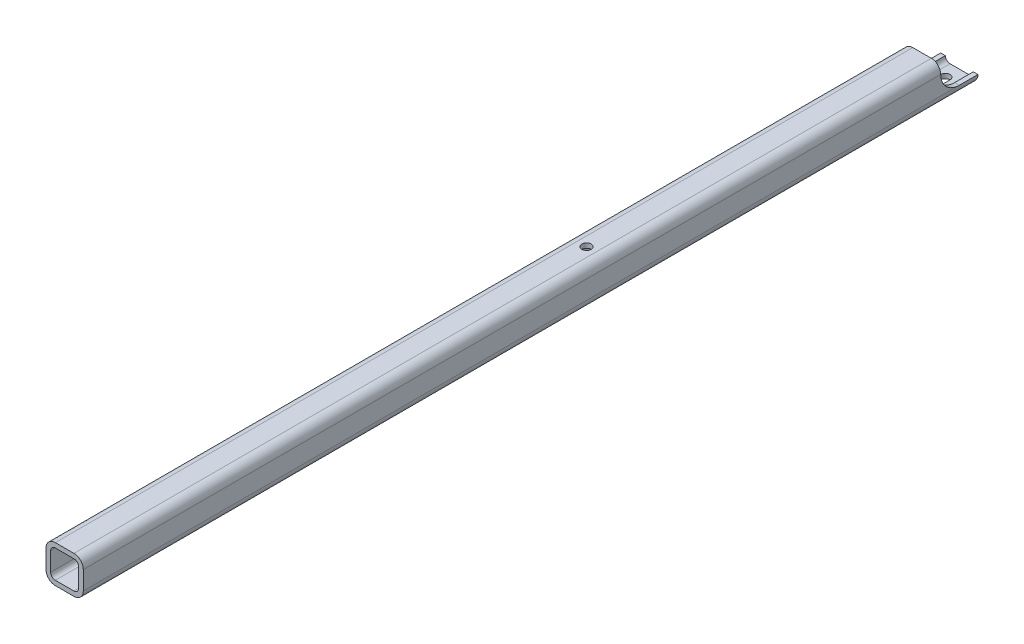
ISO-10303-21;
HEADER;
FILE_DESCRIPTION(('STEP AP214'),'2;1');
FILE_NAME('part.step','',(''),(''),'','','');
FILE_SCHEMA(('AUTOMOTIVE_DESIGN { 1 0 10303 214 1 1 1 1 }'));
ENDSEC;
DATA;
#1=APPLICATION_CONTEXT('core data for automotive mechanical design processes');
#2=APPLICATION_PROTOCOL_DEFINITION('international standard','automotive_design',2000,#1);
#3=PRODUCT_CONTEXT('',#1,'mechanical');
#4=PRODUCT('Part','Part','',(#3));
#5=PRODUCT_RELATED_PRODUCT_CATEGORY('part','',(#4));
#6=PRODUCT_DEFINITION_FORMATION('','',#4);
#7=PRODUCT_DEFINITION_CONTEXT('part definition',#1,'design');
#8=PRODUCT_DEFINITION('design','',#6,#7);
#9=PRODUCT_DEFINITION_SHAPE('','',#8);
#10=(LENGTH_UNIT() NAMED_UNIT(*) SI_UNIT(.MILLI.,.METRE.));
#11=(NAMED_UNIT(*) PLANE_ANGLE_UNIT() SI_UNIT($,.RADIAN.));
#12=(NAMED_UNIT(*) SI_UNIT($,.STERADIAN.) SOLID_ANGLE_UNIT());
#13=UNCERTAINTY_MEASURE_WITH_UNIT(LENGTH_MEASURE(1.E-05),#10,'distance_accuracy_value','');
#14=(GEOMETRIC_REPRESENTATION_CONTEXT(3) GLOBAL_UNCERTAINTY_ASSIGNED_CONTEXT((#13)) GLOBAL_UNIT_ASSIGNED_CONTEXT((#10,
#11,#12)) REPRESENTATION_CONTEXT('',''));
#15=CARTESIAN_POINT('',(0.,0.,0.));
#16=DIRECTION('',(0.,0.,1.));
#17=DIRECTION('',(1.,0.,0.));
#18=AXIS2_PLACEMENT_3D('',#15,#16,#17);
#19=CARTESIAN_POINT('',(38.1,38.1,609.6));
#20=DIRECTION('',(0.,0.,1.));
#21=DIRECTION('',(1.,0.,0.));
#22=AXIS2_PLACEMENT_3D('',#19,#20,#21);
#23=PLANE('',#22);
#24=CARTESIAN_POINT('',(38.1,38.1,609.6));
#25=DIRECTION('',(0.,0.,1.));
#26=DIRECTION('',(1.,0.,0.));
#27=AXIS2_PLACEMENT_3D('',#24,#25,#26);
#28=CIRCLE('',#27,12.7);
#29=CARTESIAN_POINT('',(50.8,38.1,609.6));
#30=VERTEX_POINT('',#29);
#31=CARTESIAN_POINT('',(38.1,50.8,609.6));
#32=VERTEX_POINT('',#31);
#33=EDGE_CURVE('E291',#30,#32,#28,.T.);
#34=ORIENTED_EDGE('',*,*,#33,.T.);
#35=DIRECTION('',(-1.,0.,0.));
#36=VECTOR('',#35,1.);
#37=CARTESIAN_POINT('',(38.1,50.8,609.6));
#38=LINE('',#37,#36);
#39=CARTESIAN_POINT('',(12.7,50.8,609.6));
#40=VERTEX_POINT('',#39);
#41=EDGE_CURVE('E294',#32,#40,#38,.T.);
#42=ORIENTED_EDGE('',*,*,#41,.T.);
#43=CARTESIAN_POINT('',(12.7,38.1,609.6));
#44=DIRECTION('',(0.,0.,1.));
#45=DIRECTION('',(1.,0.,0.));
#46=AXIS2_PLACEMENT_3D('',#43,#44,#45);
#47=CIRCLE('',#46,12.7);
#48=CARTESIAN_POINT('',(0.,38.1,609.6));
#49=VERTEX_POINT('',#48);
#50=EDGE_CURVE('E297',#40,#49,#47,.T.);
#51=ORIENTED_EDGE('',*,*,#50,.T.);
#52=DIRECTION('',(0.,-1.,0.));
#53=VECTOR('',#52,1.);
#54=CARTESIAN_POINT('',(0.,12.7,609.6));
#55=LINE('',#54,#53);
#56=CARTESIAN_POINT('',(0.,12.7,609.6));
#57=VERTEX_POINT('',#56);
#58=EDGE_CURVE('E299',#49,#57,#55,.T.);
#59=ORIENTED_EDGE('',*,*,#58,.T.);
#60=CARTESIAN_POINT('',(12.7,12.7,609.6));
#61=DIRECTION('',(0.,0.,1.));
#62=DIRECTION('',(1.,0.,0.));
#63=AXIS2_PLACEMENT_3D('',#60,#61,#62);
#64=CIRCLE('',#63,12.7);
#65=CARTESIAN_POINT('',(12.7,0.,609.6));
#66=VERTEX_POINT('',#65);
#67=EDGE_CURVE('E301',#57,#66,#64,.T.);
#68=ORIENTED_EDGE('',*,*,#67,.T.);
#69=DIRECTION('',(1.,0.,0.));
#70=VECTOR('',#69,1.);
#71=CARTESIAN_POINT('',(12.7,0.,609.6));
#72=LINE('',#71,#70);
#73=CARTESIAN_POINT('',(38.1,0.,609.6));
#74=VERTEX_POINT('',#73);
#75=EDGE_CURVE('E303',#66,#74,#72,.T.);
#76=ORIENTED_EDGE('',*,*,#75,.T.);
#77=CARTESIAN_POINT('',(38.1,12.7,609.6));
#78=DIRECTION('',(0.,0.,1.));
#79=DIRECTION('',(1.,0.,0.));
#80=AXIS2_PLACEMENT_3D('',#77,#78,#79);
#81=CIRCLE('',#80,12.7);
#82=CARTESIAN_POINT('',(50.8,12.7,609.6));
#83=VERTEX_POINT('',#82);
#84=EDGE_CURVE('E305',#74,#83,#81,.T.);
#85=ORIENTED_EDGE('',*,*,#84,.T.);
#86=DIRECTION('',(0.,1.,0.));
#87=VECTOR('',#86,1.);
#88=CARTESIAN_POINT('',(50.8,38.1,609.6));
#89=LINE('',#88,#87);
#90=EDGE_CURVE('E307',#83,#30,#89,.T.);
#91=ORIENTED_EDGE('',*,*,#90,.T.);
#92=EDGE_LOOP('',(#34,#42,#51,#59,#68,#76,#85,#91));
#93=FACE_BOUND('',#92,.T.);
#94=DIRECTION('',(0.,-1.,0.));
#95=VECTOR('',#94,1.);
#96=CARTESIAN_POINT('',(6.35,12.7,609.6));
#97=LINE('',#96,#95);
#98=CARTESIAN_POINT('',(6.35,38.1,609.6));
#99=VERTEX_POINT('',#98);
#100=CARTESIAN_POINT('',(6.35,12.7,609.6));
#101=VERTEX_POINT('',#100);
#102=EDGE_CURVE('E247',#99,#101,#97,.T.);
#103=ORIENTED_EDGE('',*,*,#102,.F.);
#104=CARTESIAN_POINT('',(12.7,38.1,609.6));
#105=DIRECTION('',(0.,0.,1.));
#106=DIRECTION('',(1.,0.,0.));
#107=AXIS2_PLACEMENT_3D('',#104,#105,#106);
#108=CIRCLE('',#107,6.35);
#109=CARTESIAN_POINT('',(12.7,44.45,609.6));
#110=VERTEX_POINT('',#109);
#111=EDGE_CURVE('E245',#110,#99,#108,.T.);
#112=ORIENTED_EDGE('',*,*,#111,.F.);
#113=DIRECTION('',(-1.,0.,0.));
#114=VECTOR('',#113,1.);
#115=CARTESIAN_POINT('',(38.1,44.45,609.6));
#116=LINE('',#115,#114);
#117=CARTESIAN_POINT('',(38.1,44.45,609.6));
#118=VERTEX_POINT('',#117);
#119=EDGE_CURVE('E261',#118,#110,#116,.T.);
#120=ORIENTED_EDGE('',*,*,#119,.F.);
#121=CARTESIAN_POINT('',(38.1,38.1,609.6));
#122=DIRECTION('',(0.,0.,1.));
#123=DIRECTION('',(1.,0.,0.));
#124=AXIS2_PLACEMENT_3D('',#121,#122,#123);
#125=CIRCLE('',#124,6.35);
#126=CARTESIAN_POINT('',(44.45,38.1,609.6));
#127=VERTEX_POINT('',#126);
#128=EDGE_CURVE('E258',#127,#118,#125,.T.);
#129=ORIENTED_EDGE('',*,*,#128,.F.);
#130=DIRECTION('',(0.,1.,0.));
#131=VECTOR('',#130,1.);
#132=CARTESIAN_POINT('',(44.45,38.1,609.6));
#133=LINE('',#132,#131);
#134=CARTESIAN_POINT('',(44.45,12.7,609.6));
#135=VERTEX_POINT('',#134);
#136=EDGE_CURVE('E256',#135,#127,#133,.T.);
#137=ORIENTED_EDGE('',*,*,#136,.F.);
#138=CARTESIAN_POINT('',(38.1,12.7,609.6));
#139=DIRECTION('',(0.,0.,1.));
#140=DIRECTION('',(1.,0.,0.));
#141=AXIS2_PLACEMENT_3D('',#138,#139,#140);
#142=CIRCLE('',#141,6.35);
#143=CARTESIAN_POINT('',(38.1,6.35,609.6));
#144=VERTEX_POINT('',#143);
#145=EDGE_CURVE('E254',#144,#135,#142,.T.);
#146=ORIENTED_EDGE('',*,*,#145,.F.);
#147=DIRECTION('',(1.,0.,0.));
#148=VECTOR('',#147,1.);
#149=CARTESIAN_POINT('',(12.7,6.35,609.6));
#150=LINE('',#149,#148);
#151=CARTESIAN_POINT('',(12.7,6.35,609.6));
#152=VERTEX_POINT('',#151);
#153=EDGE_CURVE('E252',#152,#144,#150,.T.);
#154=ORIENTED_EDGE('',*,*,#153,.F.);
#155=CARTESIAN_POINT('',(12.7,12.7,609.6));
#156=DIRECTION('',(0.,0.,1.));
#157=DIRECTION('',(1.,0.,0.));
#158=AXIS2_PLACEMENT_3D('',#155,#156,#157);
#159=CIRCLE('',#158,6.35);
#160=EDGE_CURVE('E250',#101,#152,#159,.T.);
#161=ORIENTED_EDGE('',*,*,#160,.F.);
#162=EDGE_LOOP('',(#103,#112,#120,#129,#137,#146,#154,#161));
#163=FACE_BOUND('',#162,.T.);
#164=ADVANCED_FACE('F17',(#93,#163),#23,.T.);
#165=CARTESIAN_POINT('',(38.1,38.1,-609.6));
#166=DIRECTION('',(0.,0.,1.));
#167=DIRECTION('',(1.,0.,0.));
#168=AXIS2_PLACEMENT_3D('',#165,#166,#167);
#169=PLANE('',#168);
#170=CARTESIAN_POINT('',(12.7,12.7,-609.6));
#171=DIRECTION('',(0.,0.,1.));
#172=DIRECTION('',(1.,0.,0.));
#173=AXIS2_PLACEMENT_3D('',#170,#171,#172);
#174=CIRCLE('',#173,12.7);
#175=CARTESIAN_POINT('',(0.,12.7,-609.6));
#176=VERTEX_POINT('',#175);
#177=CARTESIAN_POINT('',(12.7,0.,-609.6));
#178=VERTEX_POINT('',#177);
#179=EDGE_CURVE('E290',#176,#178,#174,.T.);
#180=ORIENTED_EDGE('',*,*,#179,.F.);
#181=DIRECTION('',(1.,0.,0.));
#182=VECTOR('',#181,1.);
#183=CARTESIAN_POINT('',(0.,12.7,-609.6));
#184=LINE('',#183,#182);
#185=CARTESIAN_POINT('',(6.35,12.7,-609.6));
#186=VERTEX_POINT('',#185);
#187=EDGE_CURVE('E217',#176,#186,#184,.T.);
#188=ORIENTED_EDGE('',*,*,#187,.T.);
#189=CARTESIAN_POINT('',(12.7,12.7,-609.6));
#190=DIRECTION('',(0.,0.,1.));
#191=DIRECTION('',(1.,0.,0.));
#192=AXIS2_PLACEMENT_3D('',#189,#190,#191);
#193=CIRCLE('',#192,6.35);
#194=CARTESIAN_POINT('',(12.7,6.35,-609.6));
#195=VERTEX_POINT('',#194);
#196=EDGE_CURVE('E244',#186,#195,#193,.T.);
#197=ORIENTED_EDGE('',*,*,#196,.T.);
#198=DIRECTION('',(1.,0.,0.));
#199=VECTOR('',#198,1.);
#200=CARTESIAN_POINT('',(12.7,6.35,-609.6));
#201=LINE('',#200,#199);
#202=CARTESIAN_POINT('',(38.1,6.35,-609.6));
#203=VERTEX_POINT('',#202);
#204=EDGE_CURVE('E266',#195,#203,#201,.T.);
#205=ORIENTED_EDGE('',*,*,#204,.T.);
#206=CARTESIAN_POINT('',(38.1,12.7,-609.6));
#207=DIRECTION('',(0.,0.,1.));
#208=DIRECTION('',(1.,0.,0.));
#209=AXIS2_PLACEMENT_3D('',#206,#207,#208);
#210=CIRCLE('',#209,6.35);
#211=CARTESIAN_POINT('',(44.45,12.7,-609.6));
#212=VERTEX_POINT('',#211);
#213=EDGE_CURVE('E248',#203,#212,#210,.T.);
#214=ORIENTED_EDGE('',*,*,#213,.T.);
#215=CARTESIAN_POINT('',(50.8,12.7,-609.6));
#216=VERTEX_POINT('',#215);
#217=EDGE_CURVE('E212',#212,#216,#184,.T.);
#218=ORIENTED_EDGE('',*,*,#217,.T.);
#219=CARTESIAN_POINT('',(38.1,12.7,-609.6));
#220=DIRECTION('',(0.,0.,1.));
#221=DIRECTION('',(1.,0.,0.));
#222=AXIS2_PLACEMENT_3D('',#219,#220,#221);
#223=CIRCLE('',#222,12.7);
#224=CARTESIAN_POINT('',(38.1,0.,-609.6));
#225=VERTEX_POINT('',#224);
#226=EDGE_CURVE('E295',#225,#216,#223,.T.);
#227=ORIENTED_EDGE('',*,*,#226,.F.);
#228=DIRECTION('',(1.,0.,0.));
#229=VECTOR('',#228,1.);
#230=CARTESIAN_POINT('',(12.7,0.,-609.6));
#231=LINE('',#230,#229);
#232=EDGE_CURVE('E311',#178,#225,#231,.T.);
#233=ORIENTED_EDGE('',*,*,#232,.F.);
#234=EDGE_LOOP('',(#180,#188,#197,#205,#214,#218,#227,#233));
#235=FACE_BOUND('',#234,.T.);
#236=ADVANCED_FACE('F418',(#235),#169,.F.);
#237=CARTESIAN_POINT('',(38.1,38.1,609.6));
#238=DIRECTION('',(0.,0.,-1.));
#239=DIRECTION('',(-1.,0.,0.));
#240=AXIS2_PLACEMENT_3D('',#237,#238,#239);
#241=CYLINDRICAL_SURFACE('',#240,12.7);
#242=DIRECTION('',(0.,0.,-1.));
#243=VECTOR('',#242,1.);
#244=CARTESIAN_POINT('',(50.8,38.1,609.6));
#245=LINE('',#244,#243);
#246=CARTESIAN_POINT('',(50.8,38.1,-558.8));
#247=VERTEX_POINT('',#246);
#248=EDGE_CURVE('E309',#30,#247,#245,.T.);
#249=ORIENTED_EDGE('',*,*,#248,.T.);
#250=CARTESIAN_POINT('',(38.1,38.1,-558.8));
#251=DIRECTION('',(0.,0.,1.));
#252=DIRECTION('',(0.,-1.,0.));
#253=AXIS2_PLACEMENT_3D('',#250,#251,#252);
#254=CIRCLE('',#253,12.7);
#255=CARTESIAN_POINT('',(38.1,50.8,-558.8));
#256=VERTEX_POINT('',#255);
#257=EDGE_CURVE('E227',#247,#256,#254,.T.);
#258=ORIENTED_EDGE('',*,*,#257,.T.);
#259=DIRECTION('',(0.,0.,-1.));
#260=VECTOR('',#259,1.);
#261=CARTESIAN_POINT('',(38.1,50.8,609.6));
#262=LINE('',#261,#260);
#263=EDGE_CURVE('E332',#32,#256,#262,.T.);
#264=ORIENTED_EDGE('',*,*,#263,.F.);
#265=ORIENTED_EDGE('',*,*,#33,.F.);
#266=EDGE_LOOP('',(#249,#258,#264,#265));
#267=FACE_BOUND('',#266,.T.);
#268=ADVANCED_FACE('F368',(#267),#241,.T.);
#269=CARTESIAN_POINT('',(38.1,50.8,609.6));
#270=DIRECTION('',(0.,-1.,0.));
#271=DIRECTION('',(1.,0.,0.));
#272=AXIS2_PLACEMENT_3D('',#269,#270,#271);
#273=PLANE('',#272);
#274=CARTESIAN_POINT('',(25.4,50.8,-101.6));
#275=DIRECTION('',(0.,1.,0.));
#276=DIRECTION('',(0.,0.,1.));
#277=AXIS2_PLACEMENT_3D('',#274,#275,#276);
#278=CIRCLE('',#277,6.35);
#279=CARTESIAN_POINT('',(25.4,50.8,-95.25));
#280=VERTEX_POINT('',#279);
#281=EDGE_CURVE('E232',#280,#280,#278,.T.);
#282=ORIENTED_EDGE('',*,*,#281,.F.);
#283=EDGE_LOOP('',(#282));
#284=FACE_BOUND('',#283,.T.);
#285=ORIENTED_EDGE('',*,*,#263,.T.);
#286=DIRECTION('',(1.,0.,0.));
#287=VECTOR('',#286,1.);
#288=CARTESIAN_POINT('',(0.,50.8,-558.8));
#289=LINE('',#288,#287);
#290=CARTESIAN_POINT('',(12.7,50.8,-558.8));
#291=VERTEX_POINT('',#290);
#292=EDGE_CURVE('E214',#291,#256,#289,.T.);
#293=ORIENTED_EDGE('',*,*,#292,.F.);
#294=DIRECTION('',(0.,0.,-1.));
#295=VECTOR('',#294,1.);
#296=CARTESIAN_POINT('',(12.7,50.8,609.6));
#297=LINE('',#296,#295);
#298=EDGE_CURVE('E329',#40,#291,#297,.T.);
#299=ORIENTED_EDGE('',*,*,#298,.F.);
#300=ORIENTED_EDGE('',*,*,#41,.F.);
#301=EDGE_LOOP('',(#285,#293,#299,#300));
#302=FACE_BOUND('',#301,.T.);
#303=ADVANCED_FACE('F430',(#284,#302),#273,.F.);
#304=CARTESIAN_POINT('',(12.7,38.1,609.6));
#305=DIRECTION('',(0.,0.,-1.));
#306=DIRECTION('',(-1.,0.,0.));
#307=AXIS2_PLACEMENT_3D('',#304,#305,#306);
#308=CYLINDRICAL_SURFACE('',#307,12.7);
#309=ORIENTED_EDGE('',*,*,#298,.T.);
#310=CARTESIAN_POINT('',(12.7,38.1,-558.8));
#311=DIRECTION('',(0.,0.,1.));
#312=DIRECTION('',(0.,-1.,0.));
#313=AXIS2_PLACEMENT_3D('',#310,#311,#312);
#314=CIRCLE('',#313,12.7);
#315=CARTESIAN_POINT('',(0.,38.1,-558.8));
#316=VERTEX_POINT('',#315);
#317=EDGE_CURVE('E224',#291,#316,#314,.T.);
#318=ORIENTED_EDGE('',*,*,#317,.T.);
#319=DIRECTION('',(0.,0.,-1.));
#320=VECTOR('',#319,1.);
#321=CARTESIAN_POINT('',(0.,38.1,609.6));
#322=LINE('',#321,#320);
#323=EDGE_CURVE('E326',#49,#316,#322,.T.);
#324=ORIENTED_EDGE('',*,*,#323,.F.);
#325=ORIENTED_EDGE('',*,*,#50,.F.);
#326=EDGE_LOOP('',(#309,#318,#324,#325));
#327=FACE_BOUND('',#326,.T.);
#328=ADVANCED_FACE('F397',(#327),#308,.T.);
#329=CARTESIAN_POINT('',(0.,12.7,609.6));
#330=DIRECTION('',(1.,0.,0.));
#331=DIRECTION('',(0.,1.,0.));
#332=AXIS2_PLACEMENT_3D('',#329,#330,#331);
#333=PLANE('',#332);
#334=ORIENTED_EDGE('',*,*,#323,.T.);
#335=CARTESIAN_POINT('',(0.,38.1,-584.2));
#336=DIRECTION('',(1.,0.,0.));
#337=DIRECTION('',(0.,1.,0.));
#338=AXIS2_PLACEMENT_3D('',#335,#336,#337);
#339=CIRCLE('',#338,25.4);
#340=CARTESIAN_POINT('',(0.,12.7,-584.2));
#341=VERTEX_POINT('',#340);
#342=EDGE_CURVE('E349',#316,#341,#339,.T.);
#343=ORIENTED_EDGE('',*,*,#342,.T.);
#344=DIRECTION('',(0.,0.,-1.));
#345=VECTOR('',#344,1.);
#346=CARTESIAN_POINT('',(0.,12.7,609.6));
#347=LINE('',#346,#345);
#348=EDGE_CURVE('E41',#57,#341,#347,.T.);
#349=ORIENTED_EDGE('',*,*,#348,.F.);
#350=ORIENTED_EDGE('',*,*,#58,.F.);
#351=EDGE_LOOP('',(#334,#343,#349,#350));
#352=FACE_BOUND('',#351,.T.);
#353=ADVANCED_FACE('F402',(#352),#333,.F.);
#354=CARTESIAN_POINT('',(12.7,12.7,609.6));
#355=DIRECTION('',(0.,0.,-1.));
#356=DIRECTION('',(-1.,0.,0.));
#357=AXIS2_PLACEMENT_3D('',#354,#355,#356);
#358=CYLINDRICAL_SURFACE('',#357,12.7);
#359=ORIENTED_EDGE('',*,*,#179,.T.);
#360=DIRECTION('',(0.,0.,-1.));
#361=VECTOR('',#360,1.);
#362=CARTESIAN_POINT('',(12.7,0.,609.6));
#363=LINE('',#362,#361);
#364=EDGE_CURVE('E322',#66,#178,#363,.T.);
#365=ORIENTED_EDGE('',*,*,#364,.F.);
#366=ORIENTED_EDGE('',*,*,#67,.F.);
#367=ORIENTED_EDGE('',*,*,#348,.T.);
#368=DIRECTION('',(0.,0.,-1.));
#369=VECTOR('',#368,1.);
#370=CARTESIAN_POINT('',(0.,12.7,-609.6));
#371=LINE('',#370,#369);
#372=EDGE_CURVE('E210',#341,#176,#371,.T.);
#373=ORIENTED_EDGE('',*,*,#372,.T.);
#374=EDGE_LOOP('',(#359,#365,#366,#367,#373));
#375=FACE_BOUND('',#374,.T.);
#376=ADVANCED_FACE('F422',(#375),#358,.T.);
#377=CARTESIAN_POINT('',(12.7,0.,609.6));
#378=DIRECTION('',(0.,1.,0.));
#379=DIRECTION('',(-1.,0.,0.));
#380=AXIS2_PLACEMENT_3D('',#377,#378,#379);
#381=PLANE('',#380);
#382=DIRECTION('',(0.,0.,1.));
#383=VECTOR('',#382,1.);
#384=CARTESIAN_POINT('',(31.75,0.,-590.55));
#385=LINE('',#384,#383);
#386=CARTESIAN_POINT('',(31.75,0.,-590.55));
#387=VERTEX_POINT('',#386);
#388=CARTESIAN_POINT('',(31.75,0.,-571.5));
#389=VERTEX_POINT('',#388);
#390=EDGE_CURVE('E194',#387,#389,#385,.T.);
#391=ORIENTED_EDGE('',*,*,#390,.F.);
#392=CARTESIAN_POINT('',(25.4,0.,-590.55));
#393=DIRECTION('',(0.,-1.,0.));
#394=DIRECTION('',(1.,0.,0.));
#395=AXIS2_PLACEMENT_3D('',#392,#393,#394);
#396=CIRCLE('',#395,6.35);
#397=CARTESIAN_POINT('',(19.05,0.,-590.55));
#398=VERTEX_POINT('',#397);
#399=EDGE_CURVE('E186',#398,#387,#396,.T.);
#400=ORIENTED_EDGE('',*,*,#399,.F.);
#401=DIRECTION('',(0.,0.,-1.));
#402=VECTOR('',#401,1.);
#403=CARTESIAN_POINT('',(19.05,0.,-590.55));
#404=LINE('',#403,#402);
#405=CARTESIAN_POINT('',(19.05,0.,-571.5));
#406=VERTEX_POINT('',#405);
#407=EDGE_CURVE('E187',#406,#398,#404,.T.);
#408=ORIENTED_EDGE('',*,*,#407,.F.);
#409=CARTESIAN_POINT('',(25.4,0.,-571.5));
#410=DIRECTION('',(0.,-1.,0.));
#411=DIRECTION('',(1.,0.,0.));
#412=AXIS2_PLACEMENT_3D('',#409,#410,#411);
#413=CIRCLE('',#412,6.35);
#414=EDGE_CURVE('E201',#389,#406,#413,.T.);
#415=ORIENTED_EDGE('',*,*,#414,.F.);
#416=EDGE_LOOP('',(#391,#400,#408,#415));
#417=FACE_BOUND('',#416,.T.);
#418=CARTESIAN_POINT('',(25.4,0.,-101.6));
#419=DIRECTION('',(0.,1.,0.));
#420=DIRECTION('',(0.,0.,1.));
#421=AXIS2_PLACEMENT_3D('',#418,#419,#420);
#422=CIRCLE('',#421,6.35);
#423=CARTESIAN_POINT('',(25.4,0.,-95.25));
#424=VERTEX_POINT('',#423);
#425=EDGE_CURVE('E235',#424,#424,#422,.T.);
#426=ORIENTED_EDGE('',*,*,#425,.T.);
#427=EDGE_LOOP('',(#426));
#428=FACE_BOUND('',#427,.T.);
#429=ORIENTED_EDGE('',*,*,#232,.T.);
#430=DIRECTION('',(0.,0.,-1.));
#431=VECTOR('',#430,1.);
#432=CARTESIAN_POINT('',(38.1,0.,609.6));
#433=LINE('',#432,#431);
#434=EDGE_CURVE('E319',#74,#225,#433,.T.);
#435=ORIENTED_EDGE('',*,*,#434,.F.);
#436=ORIENTED_EDGE('',*,*,#75,.F.);
#437=ORIENTED_EDGE('',*,*,#364,.T.);
#438=EDGE_LOOP('',(#429,#435,#436,#437));
#439=FACE_BOUND('',#438,.T.);
#440=ADVANCED_FACE('F425',(#417,#428,#439),#381,.F.);
#441=CARTESIAN_POINT('',(38.1,12.7,609.6));
#442=DIRECTION('',(0.,0.,-1.));
#443=DIRECTION('',(-1.,0.,0.));
#444=AXIS2_PLACEMENT_3D('',#441,#442,#443);
#445=CYLINDRICAL_SURFACE('',#444,12.7);
#446=ORIENTED_EDGE('',*,*,#226,.T.);
#447=DIRECTION('',(0.,0.,-1.));
#448=VECTOR('',#447,1.);
#449=CARTESIAN_POINT('',(50.8,12.7,-609.6));
#450=LINE('',#449,#448);
#451=CARTESIAN_POINT('',(50.8,12.7,-584.2));
#452=VERTEX_POINT('',#451);
#453=EDGE_CURVE('E178',#452,#216,#450,.T.);
#454=ORIENTED_EDGE('',*,*,#453,.F.);
#455=DIRECTION('',(0.,0.,-1.));
#456=VECTOR('',#455,1.);
#457=CARTESIAN_POINT('',(50.8,12.7,609.6));
#458=LINE('',#457,#456);
#459=EDGE_CURVE('E317',#83,#452,#458,.T.);
#460=ORIENTED_EDGE('',*,*,#459,.F.);
#461=ORIENTED_EDGE('',*,*,#84,.F.);
#462=ORIENTED_EDGE('',*,*,#434,.T.);
#463=EDGE_LOOP('',(#446,#454,#460,#461,#462));
#464=FACE_BOUND('',#463,.T.);
#465=ADVANCED_FACE('F455',(#464),#445,.T.);
#466=CARTESIAN_POINT('',(50.8,38.1,609.6));
#467=DIRECTION('',(-1.,0.,0.));
#468=DIRECTION('',(0.,-1.,0.));
#469=AXIS2_PLACEMENT_3D('',#466,#467,#468);
#470=PLANE('',#469);
#471=ORIENTED_EDGE('',*,*,#459,.T.);
#472=CARTESIAN_POINT('',(50.8,38.1,-584.2));
#473=DIRECTION('',(-1.,0.,0.));
#474=DIRECTION('',(0.,-1.,0.));
#475=AXIS2_PLACEMENT_3D('',#472,#473,#474);
#476=CIRCLE('',#475,25.4);
#477=EDGE_CURVE('E25',#452,#247,#476,.T.);
#478=ORIENTED_EDGE('',*,*,#477,.T.);
#479=ORIENTED_EDGE('',*,*,#248,.F.);
#480=ORIENTED_EDGE('',*,*,#90,.F.);
#481=EDGE_LOOP('',(#471,#478,#479,#480));
#482=FACE_BOUND('',#481,.T.);
#483=ADVANCED_FACE('F355',(#482),#470,.F.);
#484=CARTESIAN_POINT('',(12.7,38.1,609.6));
#485=DIRECTION('',(0.,0.,-1.));
#486=DIRECTION('',(-1.,0.,0.));
#487=AXIS2_PLACEMENT_3D('',#484,#485,#486);
#488=CYLINDRICAL_SURFACE('',#487,6.35);
#489=CARTESIAN_POINT('',(12.7,38.1,-558.8));
#490=DIRECTION('',(0.,0.,1.));
#491=DIRECTION('',(0.,-1.,0.));
#492=AXIS2_PLACEMENT_3D('',#489,#490,#491);
#493=CIRCLE('',#492,6.35);
#494=CARTESIAN_POINT('',(12.7,44.45,-558.8));
#495=VERTEX_POINT('',#494);
#496=CARTESIAN_POINT('',(6.35,38.1,-558.8));
#497=VERTEX_POINT('',#496);
#498=EDGE_CURVE('E221',#495,#497,#493,.T.);
#499=ORIENTED_EDGE('',*,*,#498,.F.);
#500=DIRECTION('',(0.,0.,-1.));
#501=VECTOR('',#500,1.);
#502=CARTESIAN_POINT('',(12.7,44.45,609.6));
#503=LINE('',#502,#501);
#504=EDGE_CURVE('E263',#110,#495,#503,.T.);
#505=ORIENTED_EDGE('',*,*,#504,.F.);
#506=ORIENTED_EDGE('',*,*,#111,.T.);
#507=DIRECTION('',(0.,0.,-1.));
#508=VECTOR('',#507,1.);
#509=CARTESIAN_POINT('',(6.35,38.1,609.6));
#510=LINE('',#509,#508);
#511=EDGE_CURVE('E287',#99,#497,#510,.T.);
#512=ORIENTED_EDGE('',*,*,#511,.T.);
#513=EDGE_LOOP('',(#499,#505,#506,#512));
#514=FACE_BOUND('',#513,.T.);
#515=ADVANCED_FACE('F389',(#514),#488,.F.);
#516=CARTESIAN_POINT('',(6.35,12.7,609.6));
#517=DIRECTION('',(1.,0.,0.));
#518=DIRECTION('',(0.,1.,0.));
#519=AXIS2_PLACEMENT_3D('',#516,#517,#518);
#520=PLANE('',#519);
#521=DIRECTION('',(0.,0.,-1.));
#522=VECTOR('',#521,1.);
#523=CARTESIAN_POINT('',(6.35,12.7,609.6));
#524=LINE('',#523,#522);
#525=CARTESIAN_POINT('',(6.35,12.7,-584.2));
#526=VERTEX_POINT('',#525);
#527=EDGE_CURVE('E285',#101,#526,#524,.T.);
#528=ORIENTED_EDGE('',*,*,#527,.T.);
#529=CARTESIAN_POINT('',(6.35,38.1,-584.2));
#530=DIRECTION('',(1.,0.,0.));
#531=DIRECTION('',(0.,1.,0.));
#532=AXIS2_PLACEMENT_3D('',#529,#530,#531);
#533=CIRCLE('',#532,25.4);
#534=EDGE_CURVE('E347',#526,#497,#533,.F.);
#535=ORIENTED_EDGE('',*,*,#534,.T.);
#536=ORIENTED_EDGE('',*,*,#511,.F.);
#537=ORIENTED_EDGE('',*,*,#102,.T.);
#538=EDGE_LOOP('',(#528,#535,#536,#537));
#539=FACE_BOUND('',#538,.T.);
#540=ADVANCED_FACE('F501',(#539),#520,.T.);
#541=CARTESIAN_POINT('',(12.7,12.7,609.6));
#542=DIRECTION('',(0.,0.,-1.));
#543=DIRECTION('',(-1.,0.,0.));
#544=AXIS2_PLACEMENT_3D('',#541,#542,#543);
#545=CYLINDRICAL_SURFACE('',#544,6.35);
#546=ORIENTED_EDGE('',*,*,#196,.F.);
#547=DIRECTION('',(0.,0.,-1.));
#548=VECTOR('',#547,1.);
#549=CARTESIAN_POINT('',(6.35,12.6999999999997,609.6));
#550=LINE('',#549,#548);
#551=EDGE_CURVE('E230',#526,#186,#550,.T.);
#552=ORIENTED_EDGE('',*,*,#551,.F.);
#553=ORIENTED_EDGE('',*,*,#527,.F.);
#554=ORIENTED_EDGE('',*,*,#160,.T.);
#555=DIRECTION('',(0.,0.,-1.));
#556=VECTOR('',#555,1.);
#557=CARTESIAN_POINT('',(12.7,6.35,609.6));
#558=LINE('',#557,#556);
#559=EDGE_CURVE('E283',#152,#195,#558,.T.);
#560=ORIENTED_EDGE('',*,*,#559,.T.);
#561=EDGE_LOOP('',(#546,#552,#553,#554,#560));
#562=FACE_BOUND('',#561,.T.);
#563=ADVANCED_FACE('F412',(#562),#545,.F.);
#564=CARTESIAN_POINT('',(12.7,6.35,609.6));
#565=DIRECTION('',(0.,1.,0.));
#566=DIRECTION('',(-1.,0.,0.));
#567=AXIS2_PLACEMENT_3D('',#564,#565,#566);
#568=PLANE('',#567);
#569=CARTESIAN_POINT('',(25.4,6.35,-590.55));
#570=DIRECTION('',(0.,1.,0.));
#571=DIRECTION('',(-1.,0.,0.));
#572=AXIS2_PLACEMENT_3D('',#569,#570,#571);
#573=CIRCLE('',#572,6.35);
#574=CARTESIAN_POINT('',(19.05,6.35,-590.55));
#575=VERTEX_POINT('',#574);
#576=CARTESIAN_POINT('',(31.75,6.35,-590.55));
#577=VERTEX_POINT('',#576);
#578=EDGE_CURVE('E183',#575,#577,#573,.F.);
#579=ORIENTED_EDGE('',*,*,#578,.T.);
#580=DIRECTION('',(0.,0.,1.));
#581=VECTOR('',#580,1.);
#582=CARTESIAN_POINT('',(31.75,6.35,-590.55));
#583=LINE('',#582,#581);
#584=CARTESIAN_POINT('',(31.75,6.35,-571.5));
#585=VERTEX_POINT('',#584);
#586=EDGE_CURVE('E167',#577,#585,#583,.T.);
#587=ORIENTED_EDGE('',*,*,#586,.T.);
#588=CARTESIAN_POINT('',(25.4,6.35,-571.5));
#589=DIRECTION('',(0.,1.,0.));
#590=DIRECTION('',(-1.,0.,0.));
#591=AXIS2_PLACEMENT_3D('',#588,#589,#590);
#592=CIRCLE('',#591,6.35);
#593=CARTESIAN_POINT('',(19.05,6.35,-571.5));
#594=VERTEX_POINT('',#593);
#595=EDGE_CURVE('E196',#585,#594,#592,.F.);
#596=ORIENTED_EDGE('',*,*,#595,.T.);
#597=DIRECTION('',(0.,0.,-1.));
#598=VECTOR('',#597,1.);
#599=CARTESIAN_POINT('',(19.05,6.35,-590.55));
#600=LINE('',#599,#598);
#601=EDGE_CURVE('E192',#594,#575,#600,.T.);
#602=ORIENTED_EDGE('',*,*,#601,.T.);
#603=EDGE_LOOP('',(#579,#587,#596,#602));
#604=FACE_BOUND('',#603,.T.);
#605=CARTESIAN_POINT('',(25.4,6.35,-101.6));
#606=DIRECTION('',(0.,1.,0.));
#607=DIRECTION('',(-1.,0.,0.));
#608=AXIS2_PLACEMENT_3D('',#605,#606,#607);
#609=CIRCLE('',#608,6.35);
#610=CARTESIAN_POINT('',(19.05,6.35,-101.6));
#611=VERTEX_POINT('',#610);
#612=EDGE_CURVE('E241',#611,#611,#609,.T.);
#613=ORIENTED_EDGE('',*,*,#612,.F.);
#614=EDGE_LOOP('',(#613));
#615=FACE_BOUND('',#614,.T.);
#616=ORIENTED_EDGE('',*,*,#204,.F.);
#617=ORIENTED_EDGE('',*,*,#559,.F.);
#618=ORIENTED_EDGE('',*,*,#153,.T.);
#619=DIRECTION('',(0.,0.,-1.));
#620=VECTOR('',#619,1.);
#621=CARTESIAN_POINT('',(38.1,6.35,609.6));
#622=LINE('',#621,#620);
#623=EDGE_CURVE('E281',#144,#203,#622,.T.);
#624=ORIENTED_EDGE('',*,*,#623,.T.);
#625=EDGE_LOOP('',(#616,#617,#618,#624));
#626=FACE_BOUND('',#625,.T.);
#627=ADVANCED_FACE('F190',(#604,#615,#626),#568,.T.);
#628=CARTESIAN_POINT('',(38.1,12.7,609.6));
#629=DIRECTION('',(0.,0.,-1.));
#630=DIRECTION('',(-1.,0.,0.));
#631=AXIS2_PLACEMENT_3D('',#628,#629,#630);
#632=CYLINDRICAL_SURFACE('',#631,6.35);
#633=ORIENTED_EDGE('',*,*,#213,.F.);
#634=ORIENTED_EDGE('',*,*,#623,.F.);
#635=ORIENTED_EDGE('',*,*,#145,.T.);
#636=DIRECTION('',(0.,0.,-1.));
#637=VECTOR('',#636,1.);
#638=CARTESIAN_POINT('',(44.45,12.7,609.6));
#639=LINE('',#638,#637);
#640=CARTESIAN_POINT('',(44.45,12.7,-584.2));
#641=VERTEX_POINT('',#640);
#642=EDGE_CURVE('E32',#135,#641,#639,.T.);
#643=ORIENTED_EDGE('',*,*,#642,.T.);
#644=EDGE_CURVE('E279',#641,#212,#639,.T.);
#645=ORIENTED_EDGE('',*,*,#644,.T.);
#646=EDGE_LOOP('',(#633,#634,#635,#643,#645));
#647=FACE_BOUND('',#646,.T.);
#648=ADVANCED_FACE('F522',(#647),#632,.F.);
#649=CARTESIAN_POINT('',(44.45,38.1,609.6));
#650=DIRECTION('',(-1.,0.,0.));
#651=DIRECTION('',(0.,-1.,0.));
#652=AXIS2_PLACEMENT_3D('',#649,#650,#651);
#653=PLANE('',#652);
#654=DIRECTION('',(0.,0.,-1.));
#655=VECTOR('',#654,1.);
#656=CARTESIAN_POINT('',(44.45,38.1,609.6));
#657=LINE('',#656,#655);
#658=CARTESIAN_POINT('',(44.45,38.1,-558.8));
#659=VERTEX_POINT('',#658);
#660=EDGE_CURVE('E276',#127,#659,#657,.T.);
#661=ORIENTED_EDGE('',*,*,#660,.T.);
#662=CARTESIAN_POINT('',(44.45,38.1,-584.2));
#663=DIRECTION('',(-1.,0.,0.));
#664=DIRECTION('',(0.,-1.,0.));
#665=AXIS2_PLACEMENT_3D('',#662,#663,#664);
#666=CIRCLE('',#665,25.4);
#667=EDGE_CURVE('E11',#659,#641,#666,.F.);
#668=ORIENTED_EDGE('',*,*,#667,.T.);
#669=ORIENTED_EDGE('',*,*,#642,.F.);
#670=ORIENTED_EDGE('',*,*,#136,.T.);
#671=EDGE_LOOP('',(#661,#668,#669,#670));
#672=FACE_BOUND('',#671,.T.);
#673=ADVANCED_FACE('F371',(#672),#653,.T.);
#674=CARTESIAN_POINT('',(38.1,38.1,609.6));
#675=DIRECTION('',(0.,0.,-1.));
#676=DIRECTION('',(-1.,0.,0.));
#677=AXIS2_PLACEMENT_3D('',#674,#675,#676);
#678=CYLINDRICAL_SURFACE('',#677,6.35);
#679=CARTESIAN_POINT('',(38.1,38.1,-558.8));
#680=DIRECTION('',(0.,0.,1.));
#681=DIRECTION('',(0.,-1.,0.));
#682=AXIS2_PLACEMENT_3D('',#679,#680,#681);
#683=CIRCLE('',#682,6.35);
#684=CARTESIAN_POINT('',(38.1,44.45,-558.8));
#685=VERTEX_POINT('',#684);
#686=EDGE_CURVE('E216',#659,#685,#683,.T.);
#687=ORIENTED_EDGE('',*,*,#686,.F.);
#688=ORIENTED_EDGE('',*,*,#660,.F.);
#689=ORIENTED_EDGE('',*,*,#128,.T.);
#690=DIRECTION('',(0.,0.,-1.));
#691=VECTOR('',#690,1.);
#692=CARTESIAN_POINT('',(38.1,44.45,609.6));
#693=LINE('',#692,#691);
#694=EDGE_CURVE('E273',#118,#685,#693,.T.);
#695=ORIENTED_EDGE('',*,*,#694,.T.);
#696=EDGE_LOOP('',(#687,#688,#689,#695));
#697=FACE_BOUND('',#696,.T.);
#698=ADVANCED_FACE('F376',(#697),#678,.F.);
#699=CARTESIAN_POINT('',(38.1,44.45,609.6));
#700=DIRECTION('',(0.,-1.,0.));
#701=DIRECTION('',(1.,0.,0.));
#702=AXIS2_PLACEMENT_3D('',#699,#700,#701);
#703=PLANE('',#702);
#704=DIRECTION('',(-1.,0.,0.));
#705=VECTOR('',#704,1.);
#706=CARTESIAN_POINT('',(38.1,44.45,-558.8));
#707=LINE('',#706,#705);
#708=EDGE_CURVE('E335',#685,#495,#707,.T.);
#709=ORIENTED_EDGE('',*,*,#708,.F.);
#710=ORIENTED_EDGE('',*,*,#694,.F.);
#711=ORIENTED_EDGE('',*,*,#119,.T.);
#712=ORIENTED_EDGE('',*,*,#504,.T.);
#713=EDGE_LOOP('',(#709,#710,#711,#712));
#714=FACE_BOUND('',#713,.T.);
#715=CARTESIAN_POINT('',(25.4,44.45,-101.6));
#716=DIRECTION('',(0.,-1.,0.));
#717=DIRECTION('',(1.,0.,0.));
#718=AXIS2_PLACEMENT_3D('',#715,#716,#717);
#719=CIRCLE('',#718,6.35);
#720=CARTESIAN_POINT('',(31.75,44.45,-101.6));
#721=VERTEX_POINT('',#720);
#722=EDGE_CURVE('E238',#721,#721,#719,.T.);
#723=ORIENTED_EDGE('',*,*,#722,.F.);
#724=EDGE_LOOP('',(#723));
#725=FACE_BOUND('',#724,.T.);
#726=ADVANCED_FACE('F385',(#714,#725),#703,.T.);
#727=CARTESIAN_POINT('',(25.4,50.8,-101.6));
#728=DIRECTION('',(0.,1.,0.));
#729=DIRECTION('',(0.,0.,1.));
#730=AXIS2_PLACEMENT_3D('',#727,#728,#729);
#731=CYLINDRICAL_SURFACE('',#730,6.35);
#732=ORIENTED_EDGE('',*,*,#722,.T.);
#733=EDGE_LOOP('',(#732));
#734=FACE_BOUND('',#733,.T.);
#735=ORIENTED_EDGE('',*,*,#281,.T.);
#736=EDGE_LOOP('',(#735));
#737=FACE_BOUND('',#736,.T.);
#738=ADVANCED_FACE('F551',(#734,#737),#731,.F.);
#739=ORIENTED_EDGE('',*,*,#612,.T.);
#740=EDGE_LOOP('',(#739));
#741=FACE_BOUND('',#740,.T.);
#742=ORIENTED_EDGE('',*,*,#425,.F.);
#743=EDGE_LOOP('',(#742));
#744=FACE_BOUND('',#743,.T.);
#745=ADVANCED_FACE('F559',(#741,#744),#731,.F.);
#746=CARTESIAN_POINT('',(0.,12.7,-609.6));
#747=DIRECTION('',(0.,-1.,0.));
#748=DIRECTION('',(1.,0.,0.));
#749=AXIS2_PLACEMENT_3D('',#746,#747,#748);
#750=PLANE('',#749);
#751=ORIENTED_EDGE('',*,*,#372,.F.);
#752=DIRECTION('',(1.,0.,0.));
#753=VECTOR('',#752,1.);
#754=CARTESIAN_POINT('',(6.35,12.7,-584.2));
#755=LINE('',#754,#753);
#756=EDGE_CURVE('E337',#341,#526,#755,.T.);
#757=ORIENTED_EDGE('',*,*,#756,.T.);
#758=ORIENTED_EDGE('',*,*,#551,.T.);
#759=ORIENTED_EDGE('',*,*,#187,.F.);
#760=EDGE_LOOP('',(#751,#757,#758,#759));
#761=FACE_BOUND('',#760,.T.);
#762=ADVANCED_FACE('F407',(#761),#750,.F.);
#763=CARTESIAN_POINT('',(0.,12.7,-558.8));
#764=DIRECTION('',(0.,0.,1.));
#765=DIRECTION('',(0.,-1.,0.));
#766=AXIS2_PLACEMENT_3D('',#763,#764,#765);
#767=PLANE('',#766);
#768=ORIENTED_EDGE('',*,*,#498,.T.);
#769=DIRECTION('',(1.,0.,0.));
#770=VECTOR('',#769,1.);
#771=CARTESIAN_POINT('',(0.,38.1,-558.8));
#772=LINE('',#771,#770);
#773=EDGE_CURVE('E342',#497,#316,#772,.F.);
#774=ORIENTED_EDGE('',*,*,#773,.T.);
#775=ORIENTED_EDGE('',*,*,#317,.F.);
#776=ORIENTED_EDGE('',*,*,#292,.T.);
#777=ORIENTED_EDGE('',*,*,#257,.F.);
#778=DIRECTION('',(1.,0.,0.));
#779=VECTOR('',#778,1.);
#780=CARTESIAN_POINT('',(44.45,38.1,-558.8));
#781=LINE('',#780,#779);
#782=EDGE_CURVE('E340',#247,#659,#781,.F.);
#783=ORIENTED_EDGE('',*,*,#782,.T.);
#784=ORIENTED_EDGE('',*,*,#686,.T.);
#785=ORIENTED_EDGE('',*,*,#708,.T.);
#786=EDGE_LOOP('',(#768,#774,#775,#776,#777,#783,#784,#785));
#787=FACE_BOUND('',#786,.T.);
#788=ADVANCED_FACE('F363',(#787),#767,.F.);
#789=ORIENTED_EDGE('',*,*,#644,.F.);
#790=DIRECTION('',(1.,0.,0.));
#791=VECTOR('',#790,1.);
#792=CARTESIAN_POINT('',(50.8,12.7,-584.2));
#793=LINE('',#792,#791);
#794=EDGE_CURVE('E344',#641,#452,#793,.T.);
#795=ORIENTED_EDGE('',*,*,#794,.T.);
#796=ORIENTED_EDGE('',*,*,#453,.T.);
#797=ORIENTED_EDGE('',*,*,#217,.F.);
#798=EDGE_LOOP('',(#789,#795,#796,#797));
#799=FACE_BOUND('',#798,.T.);
#800=ADVANCED_FACE('F576',(#799),#750,.F.);
#801=CARTESIAN_POINT('',(25.4,50.801,-590.55));
#802=DIRECTION('',(0.,-1.,0.));
#803=DIRECTION('',(1.,0.,0.));
#804=AXIS2_PLACEMENT_3D('',#801,#802,#803);
#805=CYLINDRICAL_SURFACE('',#804,6.35);
#806=DIRECTION('',(0.,-1.,0.));
#807=VECTOR('',#806,1.);
#808=CARTESIAN_POINT('',(19.05,50.801,-590.55));
#809=LINE('',#808,#807);
#810=EDGE_CURVE('E179',#575,#398,#809,.T.);
#811=ORIENTED_EDGE('',*,*,#810,.T.);
#812=ORIENTED_EDGE('',*,*,#399,.T.);
#813=DIRECTION('',(0.,-1.,0.));
#814=VECTOR('',#813,1.);
#815=CARTESIAN_POINT('',(31.75,50.801,-590.55));
#816=LINE('',#815,#814);
#817=EDGE_CURVE('E171',#577,#387,#816,.T.);
#818=ORIENTED_EDGE('',*,*,#817,.F.);
#819=ORIENTED_EDGE('',*,*,#578,.F.);
#820=EDGE_LOOP('',(#811,#812,#818,#819));
#821=FACE_BOUND('',#820,.T.);
#822=ADVANCED_FACE('F182',(#821),#805,.F.);
#823=CARTESIAN_POINT('',(19.05,50.801,-590.55));
#824=DIRECTION('',(-1.,0.,0.));
#825=DIRECTION('',(0.,-1.,0.));
#826=AXIS2_PLACEMENT_3D('',#823,#824,#825);
#827=PLANE('',#826);
#828=DIRECTION('',(0.,-1.,0.));
#829=VECTOR('',#828,1.);
#830=CARTESIAN_POINT('',(19.05,50.801,-571.5));
#831=LINE('',#830,#829);
#832=EDGE_CURVE('E207',#594,#406,#831,.T.);
#833=ORIENTED_EDGE('',*,*,#832,.T.);
#834=ORIENTED_EDGE('',*,*,#407,.T.);
#835=ORIENTED_EDGE('',*,*,#810,.F.);
#836=ORIENTED_EDGE('',*,*,#601,.F.);
#837=EDGE_LOOP('',(#833,#834,#835,#836));
#838=FACE_BOUND('',#837,.T.);
#839=ADVANCED_FACE('F597',(#838),#827,.F.);
#840=CARTESIAN_POINT('',(25.4,50.801,-571.5));
#841=DIRECTION('',(0.,-1.,0.));
#842=DIRECTION('',(1.,0.,0.));
#843=AXIS2_PLACEMENT_3D('',#840,#841,#842);
#844=CYLINDRICAL_SURFACE('',#843,6.35);
#845=DIRECTION('',(0.,-1.,0.));
#846=VECTOR('',#845,1.);
#847=CARTESIAN_POINT('',(31.75,50.801,-571.5));
#848=LINE('',#847,#846);
#849=EDGE_CURVE('E173',#585,#389,#848,.T.);
#850=ORIENTED_EDGE('',*,*,#849,.T.);
#851=ORIENTED_EDGE('',*,*,#414,.T.);
#852=ORIENTED_EDGE('',*,*,#832,.F.);
#853=ORIENTED_EDGE('',*,*,#595,.F.);
#854=EDGE_LOOP('',(#850,#851,#852,#853));
#855=FACE_BOUND('',#854,.T.);
#856=ADVANCED_FACE('F605',(#855),#844,.F.);
#857=CARTESIAN_POINT('',(31.75,50.801,-590.55));
#858=DIRECTION('',(1.,0.,0.));
#859=DIRECTION('',(0.,1.,0.));
#860=AXIS2_PLACEMENT_3D('',#857,#858,#859);
#861=PLANE('',#860);
#862=ORIENTED_EDGE('',*,*,#817,.T.);
#863=ORIENTED_EDGE('',*,*,#390,.T.);
#864=ORIENTED_EDGE('',*,*,#849,.F.);
#865=ORIENTED_EDGE('',*,*,#586,.F.);
#866=EDGE_LOOP('',(#862,#863,#864,#865));
#867=FACE_BOUND('',#866,.T.);
#868=ADVANCED_FACE('F169',(#867),#861,.F.);
#869=CARTESIAN_POINT('',(0.,38.1,-584.2));
#870=DIRECTION('',(-1.,0.,0.));
#871=DIRECTION('',(0.,-1.,0.));
#872=AXIS2_PLACEMENT_3D('',#869,#870,#871);
#873=CYLINDRICAL_SURFACE('',#872,25.4);
#874=ORIENTED_EDGE('',*,*,#342,.F.);
#875=ORIENTED_EDGE('',*,*,#773,.F.);
#876=ORIENTED_EDGE('',*,*,#534,.F.);
#877=ORIENTED_EDGE('',*,*,#756,.F.);
#878=EDGE_LOOP('',(#874,#875,#876,#877));
#879=FACE_BOUND('',#878,.T.);
#880=ADVANCED_FACE('F404',(#879),#873,.F.);
#881=CARTESIAN_POINT('',(0.,38.1,-584.2));
#882=DIRECTION('',(-1.,0.,0.));
#883=DIRECTION('',(0.,-1.,0.));
#884=AXIS2_PLACEMENT_3D('',#881,#882,#883);
#885=CYLINDRICAL_SURFACE('',#884,25.4);
#886=ORIENTED_EDGE('',*,*,#667,.F.);
#887=ORIENTED_EDGE('',*,*,#782,.F.);
#888=ORIENTED_EDGE('',*,*,#477,.F.);
#889=ORIENTED_EDGE('',*,*,#794,.F.);
#890=EDGE_LOOP('',(#886,#887,#888,#889));
#891=FACE_BOUND('',#890,.T.);
#892=ADVANCED_FACE('F19',(#891),#885,.F.);
#893=CLOSED_SHELL('',(#164,#236,#268,#303,#328,#353,#376,#440,#465,#483,#515,#540,#563,#627,
#648,#673,#698,#726,#738,#745,#762,#788,#800,#822,#839,#856,#868,#880,#892));
#894=MANIFOLD_SOLID_BREP('B1',#893);
#895=ADVANCED_BREP_SHAPE_REPRESENTATION('',(#18,#894),#14);
#896=SHAPE_DEFINITION_REPRESENTATION(#9,#895);
ENDSEC;
END-ISO-10303-21;
